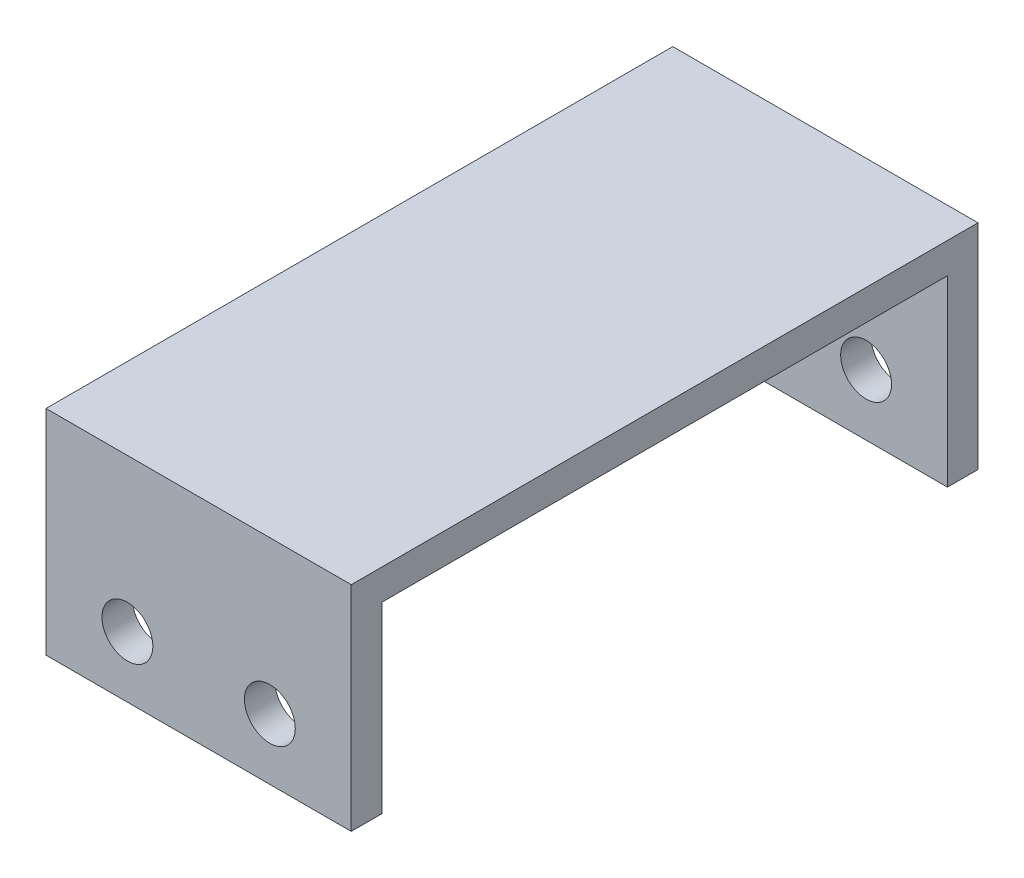
ISO-10303-21;
HEADER;
FILE_DESCRIPTION(('STEP AP214'),'2;1');
FILE_NAME('part.step','',(''),(''),'','','');
FILE_SCHEMA(('AUTOMOTIVE_DESIGN { 1 0 10303 214 1 1 1 1 }'));
ENDSEC;
DATA;
#1=APPLICATION_CONTEXT('core data for automotive mechanical design processes');
#2=APPLICATION_PROTOCOL_DEFINITION('international standard','automotive_design',2000,#1);
#3=PRODUCT_CONTEXT('',#1,'mechanical');
#4=PRODUCT('Part','Part','',(#3));
#5=PRODUCT_RELATED_PRODUCT_CATEGORY('part','',(#4));
#6=PRODUCT_DEFINITION_FORMATION('','',#4);
#7=PRODUCT_DEFINITION_CONTEXT('part definition',#1,'design');
#8=PRODUCT_DEFINITION('design','',#6,#7);
#9=PRODUCT_DEFINITION_SHAPE('','',#8);
#10=(LENGTH_UNIT() NAMED_UNIT(*) SI_UNIT(.MILLI.,.METRE.));
#11=(NAMED_UNIT(*) PLANE_ANGLE_UNIT() SI_UNIT($,.RADIAN.));
#12=(NAMED_UNIT(*) SI_UNIT($,.STERADIAN.) SOLID_ANGLE_UNIT());
#13=UNCERTAINTY_MEASURE_WITH_UNIT(LENGTH_MEASURE(1.E-05),#10,'distance_accuracy_value','');
#14=(GEOMETRIC_REPRESENTATION_CONTEXT(3) GLOBAL_UNCERTAINTY_ASSIGNED_CONTEXT((#13)) GLOBAL_UNIT_ASSIGNED_CONTEXT((#10,
#11,#12)) REPRESENTATION_CONTEXT('',''));
#15=CARTESIAN_POINT('',(0.,0.,0.));
#16=DIRECTION('',(0.,0.,1.));
#17=DIRECTION('',(1.,0.,0.));
#18=AXIS2_PLACEMENT_3D('',#15,#16,#17);
#19=CARTESIAN_POINT('',(0.,0.,0.));
#20=DIRECTION('',(0.,1.,0.));
#21=DIRECTION('',(0.,0.,1.));
#22=AXIS2_PLACEMENT_3D('',#19,#20,#21);
#23=PLANE('',#22);
#24=DIRECTION('',(-1.,0.,0.));
#25=VECTOR('',#24,1.);
#26=CARTESIAN_POINT('',(-13.0817610062893,0.,-15.8503144654088));
#27=LINE('',#26,#25);
#28=CARTESIAN_POINT('',(1.91823899371068,0.,-15.8503144654088));
#29=VERTEX_POINT('',#28);
#30=CARTESIAN_POINT('',(-13.0817610062893,0.,-15.8503144654088));
#31=VERTEX_POINT('',#30);
#32=EDGE_CURVE('E132',#29,#31,#27,.T.);
#33=ORIENTED_EDGE('',*,*,#32,.F.);
#34=DIRECTION('',(0.,0.,-1.));
#35=VECTOR('',#34,1.);
#36=CARTESIAN_POINT('',(1.91823899371068,0.,-17.3503144654088));
#37=LINE('',#36,#35);
#38=CARTESIAN_POINT('',(1.91823899371068,0.,11.9496855345912));
#39=VERTEX_POINT('',#38);
#40=EDGE_CURVE('E180',#39,#29,#37,.T.);
#41=ORIENTED_EDGE('',*,*,#40,.F.);
#42=DIRECTION('',(1.,0.,0.));
#43=VECTOR('',#42,1.);
#44=CARTESIAN_POINT('',(-13.0817610062893,0.,11.9496855345912));
#45=LINE('',#44,#43);
#46=CARTESIAN_POINT('',(-13.0817610062893,0.,11.9496855345912));
#47=VERTEX_POINT('',#46);
#48=EDGE_CURVE('E150',#47,#39,#45,.T.);
#49=ORIENTED_EDGE('',*,*,#48,.F.);
#50=DIRECTION('',(0.,0.,1.));
#51=VECTOR('',#50,1.);
#52=CARTESIAN_POINT('',(-13.0817610062893,0.,-17.3503144654088));
#53=LINE('',#52,#51);
#54=EDGE_CURVE('E57',#31,#47,#53,.T.);
#55=ORIENTED_EDGE('',*,*,#54,.F.);
#56=EDGE_LOOP('',(#33,#41,#49,#55));
#57=FACE_BOUND('',#56,.T.);
#58=ADVANCED_FACE('F39',(#57),#23,.F.);
#59=CARTESIAN_POINT('',(-13.0817610062893,1.5,-17.3503144654088));
#60=DIRECTION('',(1.,0.,0.));
#61=DIRECTION('',(0.,0.,-1.));
#62=AXIS2_PLACEMENT_3D('',#59,#60,#61);
#63=PLANE('',#62);
#64=DIRECTION('',(0.,-1.,0.));
#65=VECTOR('',#64,1.);
#66=CARTESIAN_POINT('',(-13.0817610062893,1.5,-17.3503144654088));
#67=LINE('',#66,#65);
#68=CARTESIAN_POINT('',(-13.0817610062893,1.5,-17.3503144654088));
#69=VERTEX_POINT('',#68);
#70=CARTESIAN_POINT('',(-13.0817610062893,-9.,-17.3503144654088));
#71=VERTEX_POINT('',#70);
#72=EDGE_CURVE('E108',#69,#71,#67,.T.);
#73=ORIENTED_EDGE('',*,*,#72,.T.);
#74=DIRECTION('',(0.,0.,-1.));
#75=VECTOR('',#74,1.);
#76=CARTESIAN_POINT('',(-13.0817610062893,-9.,-17.3503144654088));
#77=LINE('',#76,#75);
#78=CARTESIAN_POINT('',(-13.0817610062893,-9.,-15.8503144654088));
#79=VERTEX_POINT('',#78);
#80=EDGE_CURVE('E111',#79,#71,#77,.T.);
#81=ORIENTED_EDGE('',*,*,#80,.F.);
#82=DIRECTION('',(0.,1.,0.));
#83=VECTOR('',#82,1.);
#84=CARTESIAN_POINT('',(-13.0817610062893,-9.,-15.8503144654088));
#85=LINE('',#84,#83);
#86=EDGE_CURVE('E143',#79,#31,#85,.T.);
#87=ORIENTED_EDGE('',*,*,#86,.T.);
#88=ORIENTED_EDGE('',*,*,#54,.T.);
#89=DIRECTION('',(0.,1.,0.));
#90=VECTOR('',#89,1.);
#91=CARTESIAN_POINT('',(-13.0817610062893,-9.,11.9496855345912));
#92=LINE('',#91,#90);
#93=CARTESIAN_POINT('',(-13.0817610062893,-9.,11.9496855345912));
#94=VERTEX_POINT('',#93);
#95=EDGE_CURVE('E173',#94,#47,#92,.T.);
#96=ORIENTED_EDGE('',*,*,#95,.F.);
#97=DIRECTION('',(0.,0.,-1.));
#98=VECTOR('',#97,1.);
#99=CARTESIAN_POINT('',(-13.0817610062893,-9.,13.4496855345912));
#100=LINE('',#99,#98);
#101=CARTESIAN_POINT('',(-13.0817610062893,-9.,13.4496855345912));
#102=VERTEX_POINT('',#101);
#103=EDGE_CURVE('E151',#102,#94,#100,.T.);
#104=ORIENTED_EDGE('',*,*,#103,.F.);
#105=DIRECTION('',(0.,-1.,0.));
#106=VECTOR('',#105,1.);
#107=CARTESIAN_POINT('',(-13.0817610062893,1.5,13.4496855345912));
#108=LINE('',#107,#106);
#109=CARTESIAN_POINT('',(-13.0817610062893,1.5,13.4496855345912));
#110=VERTEX_POINT('',#109);
#111=EDGE_CURVE('E11',#110,#102,#108,.T.);
#112=ORIENTED_EDGE('',*,*,#111,.F.);
#113=DIRECTION('',(0.,0.,1.));
#114=VECTOR('',#113,1.);
#115=CARTESIAN_POINT('',(-13.0817610062893,1.5,-17.3503144654088));
#116=LINE('',#115,#114);
#117=EDGE_CURVE('E113',#69,#110,#116,.T.);
#118=ORIENTED_EDGE('',*,*,#117,.F.);
#119=EDGE_LOOP('',(#73,#81,#87,#88,#96,#104,#112,#118));
#120=FACE_BOUND('',#119,.T.);
#121=ADVANCED_FACE('F41',(#120),#63,.F.);
#122=CARTESIAN_POINT('',(-13.0817610062893,1.5,13.4496855345912));
#123=DIRECTION('',(0.,0.,-1.));
#124=DIRECTION('',(-1.,0.,0.));
#125=AXIS2_PLACEMENT_3D('',#122,#123,#124);
#126=PLANE('',#125);
#127=CARTESIAN_POINT('',(-9.08176100628932,-6.,13.4496855345912));
#128=DIRECTION('',(0.,0.,-1.));
#129=DIRECTION('',(-1.,0.,0.));
#130=AXIS2_PLACEMENT_3D('',#127,#128,#129);
#131=CIRCLE('',#130,1.25);
#132=CARTESIAN_POINT('',(-10.3317610062893,-6.,13.4496855345912));
#133=VERTEX_POINT('',#132);
#134=EDGE_CURVE('E135',#133,#133,#131,.T.);
#135=ORIENTED_EDGE('',*,*,#134,.T.);
#136=EDGE_LOOP('',(#135));
#137=FACE_BOUND('',#136,.T.);
#138=CARTESIAN_POINT('',(-2.08176100628932,-6.,13.4496855345912));
#139=DIRECTION('',(0.,0.,-1.));
#140=DIRECTION('',(-1.,0.,0.));
#141=AXIS2_PLACEMENT_3D('',#138,#139,#140);
#142=CIRCLE('',#141,1.25);
#143=CARTESIAN_POINT('',(-3.33176100628932,-6.,13.4496855345912));
#144=VERTEX_POINT('',#143);
#145=EDGE_CURVE('E206',#144,#144,#142,.T.);
#146=ORIENTED_EDGE('',*,*,#145,.T.);
#147=EDGE_LOOP('',(#146));
#148=FACE_BOUND('',#147,.T.);
#149=ORIENTED_EDGE('',*,*,#111,.T.);
#150=DIRECTION('',(-1.,0.,0.));
#151=VECTOR('',#150,1.);
#152=CARTESIAN_POINT('',(-13.0817610062893,-9.,13.4496855345912));
#153=LINE('',#152,#151);
#154=CARTESIAN_POINT('',(1.91823899371068,-9.,13.4496855345912));
#155=VERTEX_POINT('',#154);
#156=EDGE_CURVE('E162',#155,#102,#153,.T.);
#157=ORIENTED_EDGE('',*,*,#156,.F.);
#158=DIRECTION('',(0.,-1.,0.));
#159=VECTOR('',#158,1.);
#160=CARTESIAN_POINT('',(1.91823899371068,1.5,13.4496855345912));
#161=LINE('',#160,#159);
#162=CARTESIAN_POINT('',(1.91823899371068,1.5,13.4496855345912));
#163=VERTEX_POINT('',#162);
#164=EDGE_CURVE('E49',#163,#155,#161,.T.);
#165=ORIENTED_EDGE('',*,*,#164,.F.);
#166=DIRECTION('',(1.,0.,0.));
#167=VECTOR('',#166,1.);
#168=CARTESIAN_POINT('',(-13.0817610062893,1.5,13.4496855345912));
#169=LINE('',#168,#167);
#170=EDGE_CURVE('E179',#110,#163,#169,.T.);
#171=ORIENTED_EDGE('',*,*,#170,.F.);
#172=EDGE_LOOP('',(#149,#157,#165,#171));
#173=FACE_BOUND('',#172,.T.);
#174=ADVANCED_FACE('F254',(#137,#148,#173),#126,.F.);
#175=CARTESIAN_POINT('',(1.91823899371068,1.5,-17.3503144654088));
#176=DIRECTION('',(-1.,0.,0.));
#177=DIRECTION('',(0.,0.,1.));
#178=AXIS2_PLACEMENT_3D('',#175,#176,#177);
#179=PLANE('',#178);
#180=ORIENTED_EDGE('',*,*,#164,.T.);
#181=DIRECTION('',(0.,0.,1.));
#182=VECTOR('',#181,1.);
#183=CARTESIAN_POINT('',(1.91823899371068,-9.,13.4496855345912));
#184=LINE('',#183,#182);
#185=CARTESIAN_POINT('',(1.91823899371068,-9.,11.9496855345912));
#186=VERTEX_POINT('',#185);
#187=EDGE_CURVE('E158',#186,#155,#184,.T.);
#188=ORIENTED_EDGE('',*,*,#187,.F.);
#189=DIRECTION('',(0.,1.,0.));
#190=VECTOR('',#189,1.);
#191=CARTESIAN_POINT('',(1.91823899371068,-9.,11.9496855345912));
#192=LINE('',#191,#190);
#193=EDGE_CURVE('E166',#186,#39,#192,.T.);
#194=ORIENTED_EDGE('',*,*,#193,.T.);
#195=ORIENTED_EDGE('',*,*,#40,.T.);
#196=DIRECTION('',(0.,1.,0.));
#197=VECTOR('',#196,1.);
#198=CARTESIAN_POINT('',(1.91823899371068,-9.,-15.8503144654088));
#199=LINE('',#198,#197);
#200=CARTESIAN_POINT('',(1.91823899371068,-9.,-15.8503144654088));
#201=VERTEX_POINT('',#200);
#202=EDGE_CURVE('E147',#201,#29,#199,.T.);
#203=ORIENTED_EDGE('',*,*,#202,.F.);
#204=DIRECTION('',(0.,0.,1.));
#205=VECTOR('',#204,1.);
#206=CARTESIAN_POINT('',(1.91823899371068,-9.,-17.3503144654088));
#207=LINE('',#206,#205);
#208=CARTESIAN_POINT('',(1.91823899371068,-9.,-17.3503144654088));
#209=VERTEX_POINT('',#208);
#210=EDGE_CURVE('E125',#209,#201,#207,.T.);
#211=ORIENTED_EDGE('',*,*,#210,.F.);
#212=DIRECTION('',(0.,-1.,0.));
#213=VECTOR('',#212,1.);
#214=CARTESIAN_POINT('',(1.91823899371068,1.5,-17.3503144654088));
#215=LINE('',#214,#213);
#216=CARTESIAN_POINT('',(1.91823899371068,1.5,-17.3503144654088));
#217=VERTEX_POINT('',#216);
#218=EDGE_CURVE('E116',#217,#209,#215,.T.);
#219=ORIENTED_EDGE('',*,*,#218,.F.);
#220=DIRECTION('',(0.,0.,-1.));
#221=VECTOR('',#220,1.);
#222=CARTESIAN_POINT('',(1.91823899371068,1.5,-17.3503144654088));
#223=LINE('',#222,#221);
#224=EDGE_CURVE('E183',#163,#217,#223,.T.);
#225=ORIENTED_EDGE('',*,*,#224,.F.);
#226=EDGE_LOOP('',(#180,#188,#194,#195,#203,#211,#219,#225));
#227=FACE_BOUND('',#226,.T.);
#228=ADVANCED_FACE('F262',(#227),#179,.F.);
#229=CARTESIAN_POINT('',(-13.0817610062893,1.5,-17.3503144654088));
#230=DIRECTION('',(0.,0.,1.));
#231=DIRECTION('',(1.,0.,0.));
#232=AXIS2_PLACEMENT_3D('',#229,#230,#231);
#233=PLANE('',#232);
#234=CARTESIAN_POINT('',(-9.08176100628932,-6.,-17.3503144654088));
#235=DIRECTION('',(0.,0.,1.));
#236=DIRECTION('',(1.,0.,0.));
#237=AXIS2_PLACEMENT_3D('',#234,#235,#236);
#238=CIRCLE('',#237,1.25);
#239=CARTESIAN_POINT('',(-7.83176100628932,-6.,-17.3503144654088));
#240=VERTEX_POINT('',#239);
#241=EDGE_CURVE('E200',#240,#240,#238,.T.);
#242=ORIENTED_EDGE('',*,*,#241,.T.);
#243=EDGE_LOOP('',(#242));
#244=FACE_BOUND('',#243,.T.);
#245=CARTESIAN_POINT('',(-2.08176100628932,-6.,-17.3503144654088));
#246=DIRECTION('',(0.,0.,1.));
#247=DIRECTION('',(1.,0.,0.));
#248=AXIS2_PLACEMENT_3D('',#245,#246,#247);
#249=CIRCLE('',#248,1.25);
#250=CARTESIAN_POINT('',(-0.831761006289321,-6.,-17.3503144654088));
#251=VERTEX_POINT('',#250);
#252=EDGE_CURVE('E209',#251,#251,#249,.T.);
#253=ORIENTED_EDGE('',*,*,#252,.T.);
#254=EDGE_LOOP('',(#253));
#255=FACE_BOUND('',#254,.T.);
#256=ORIENTED_EDGE('',*,*,#218,.T.);
#257=DIRECTION('',(1.,0.,0.));
#258=VECTOR('',#257,1.);
#259=CARTESIAN_POINT('',(-13.0817610062893,-9.,-17.3503144654088));
#260=LINE('',#259,#258);
#261=EDGE_CURVE('E119',#71,#209,#260,.T.);
#262=ORIENTED_EDGE('',*,*,#261,.F.);
#263=ORIENTED_EDGE('',*,*,#72,.F.);
#264=DIRECTION('',(-1.,0.,0.));
#265=VECTOR('',#264,1.);
#266=CARTESIAN_POINT('',(-13.0817610062893,1.5,-17.3503144654088));
#267=LINE('',#266,#265);
#268=EDGE_CURVE('E65',#217,#69,#267,.T.);
#269=ORIENTED_EDGE('',*,*,#268,.F.);
#270=EDGE_LOOP('',(#256,#262,#263,#269));
#271=FACE_BOUND('',#270,.T.);
#272=ADVANCED_FACE('F120',(#244,#255,#271),#233,.F.);
#273=CARTESIAN_POINT('',(0.,1.5,0.));
#274=DIRECTION('',(0.,1.,0.));
#275=DIRECTION('',(0.,0.,1.));
#276=AXIS2_PLACEMENT_3D('',#273,#274,#275);
#277=PLANE('',#276);
#278=ORIENTED_EDGE('',*,*,#117,.T.);
#279=ORIENTED_EDGE('',*,*,#170,.T.);
#280=ORIENTED_EDGE('',*,*,#224,.T.);
#281=ORIENTED_EDGE('',*,*,#268,.T.);
#282=EDGE_LOOP('',(#278,#279,#280,#281));
#283=FACE_BOUND('',#282,.T.);
#284=ADVANCED_FACE('F258',(#283),#277,.T.);
#285=CARTESIAN_POINT('',(-13.0817610062893,-9.,11.9496855345912));
#286=DIRECTION('',(0.,0.,1.));
#287=DIRECTION('',(1.,0.,0.));
#288=AXIS2_PLACEMENT_3D('',#285,#286,#287);
#289=PLANE('',#288);
#290=CARTESIAN_POINT('',(-9.08176100628932,-6.,11.9496855345912));
#291=DIRECTION('',(0.,0.,1.));
#292=DIRECTION('',(1.,0.,0.));
#293=AXIS2_PLACEMENT_3D('',#290,#291,#292);
#294=CIRCLE('',#293,1.25);
#295=CARTESIAN_POINT('',(-7.83176100628932,-6.,11.9496855345912));
#296=VERTEX_POINT('',#295);
#297=EDGE_CURVE('E219',#296,#296,#294,.T.);
#298=ORIENTED_EDGE('',*,*,#297,.T.);
#299=EDGE_LOOP('',(#298));
#300=FACE_BOUND('',#299,.T.);
#301=CARTESIAN_POINT('',(-2.08176100628932,-6.,11.9496855345912));
#302=DIRECTION('',(0.,0.,1.));
#303=DIRECTION('',(1.,0.,0.));
#304=AXIS2_PLACEMENT_3D('',#301,#302,#303);
#305=CIRCLE('',#304,1.25);
#306=CARTESIAN_POINT('',(-0.831761006289321,-6.,11.9496855345912));
#307=VERTEX_POINT('',#306);
#308=EDGE_CURVE('E199',#307,#307,#305,.T.);
#309=ORIENTED_EDGE('',*,*,#308,.T.);
#310=EDGE_LOOP('',(#309));
#311=FACE_BOUND('',#310,.T.);
#312=ORIENTED_EDGE('',*,*,#48,.T.);
#313=ORIENTED_EDGE('',*,*,#193,.F.);
#314=DIRECTION('',(1.,0.,0.));
#315=VECTOR('',#314,1.);
#316=CARTESIAN_POINT('',(-13.0817610062893,-9.,11.9496855345912));
#317=LINE('',#316,#315);
#318=EDGE_CURVE('E155',#94,#186,#317,.T.);
#319=ORIENTED_EDGE('',*,*,#318,.F.);
#320=ORIENTED_EDGE('',*,*,#95,.T.);
#321=EDGE_LOOP('',(#312,#313,#319,#320));
#322=FACE_BOUND('',#321,.T.);
#323=ADVANCED_FACE('F280',(#300,#311,#322),#289,.F.);
#324=CARTESIAN_POINT('',(0.,-9.,0.));
#325=DIRECTION('',(0.,-1.,0.));
#326=DIRECTION('',(0.,0.,-1.));
#327=AXIS2_PLACEMENT_3D('',#324,#325,#326);
#328=PLANE('',#327);
#329=ORIENTED_EDGE('',*,*,#103,.T.);
#330=ORIENTED_EDGE('',*,*,#318,.T.);
#331=ORIENTED_EDGE('',*,*,#187,.T.);
#332=ORIENTED_EDGE('',*,*,#156,.T.);
#333=EDGE_LOOP('',(#329,#330,#331,#332));
#334=FACE_BOUND('',#333,.T.);
#335=ADVANCED_FACE('F277',(#334),#328,.T.);
#336=CARTESIAN_POINT('',(-13.0817610062893,-9.,-15.8503144654088));
#337=DIRECTION('',(0.,0.,-1.));
#338=DIRECTION('',(-1.,0.,0.));
#339=AXIS2_PLACEMENT_3D('',#336,#337,#338);
#340=PLANE('',#339);
#341=CARTESIAN_POINT('',(-9.08176100628932,-6.,-15.8503144654088));
#342=DIRECTION('',(0.,0.,-1.));
#343=DIRECTION('',(-1.,0.,0.));
#344=AXIS2_PLACEMENT_3D('',#341,#342,#343);
#345=CIRCLE('',#344,1.25);
#346=CARTESIAN_POINT('',(-10.3317610062893,-6.,-15.8503144654088));
#347=VERTEX_POINT('',#346);
#348=EDGE_CURVE('E43',#347,#347,#345,.T.);
#349=ORIENTED_EDGE('',*,*,#348,.T.);
#350=EDGE_LOOP('',(#349));
#351=FACE_BOUND('',#350,.T.);
#352=CARTESIAN_POINT('',(-2.08176100628932,-6.,-15.8503144654088));
#353=DIRECTION('',(0.,0.,-1.));
#354=DIRECTION('',(-1.,0.,0.));
#355=AXIS2_PLACEMENT_3D('',#352,#353,#354);
#356=CIRCLE('',#355,1.25);
#357=CARTESIAN_POINT('',(-3.33176100628932,-6.,-15.8503144654088));
#358=VERTEX_POINT('',#357);
#359=EDGE_CURVE('E196',#358,#358,#356,.T.);
#360=ORIENTED_EDGE('',*,*,#359,.T.);
#361=EDGE_LOOP('',(#360));
#362=FACE_BOUND('',#361,.T.);
#363=ORIENTED_EDGE('',*,*,#32,.T.);
#364=ORIENTED_EDGE('',*,*,#86,.F.);
#365=DIRECTION('',(-1.,0.,0.));
#366=VECTOR('',#365,1.);
#367=CARTESIAN_POINT('',(-13.0817610062893,-9.,-15.8503144654088));
#368=LINE('',#367,#366);
#369=EDGE_CURVE('E129',#201,#79,#368,.T.);
#370=ORIENTED_EDGE('',*,*,#369,.F.);
#371=ORIENTED_EDGE('',*,*,#202,.T.);
#372=EDGE_LOOP('',(#363,#364,#370,#371));
#373=FACE_BOUND('',#372,.T.);
#374=ADVANCED_FACE('F230',(#351,#362,#373),#340,.F.);
#375=CARTESIAN_POINT('',(0.,-9.,0.));
#376=DIRECTION('',(0.,1.,0.));
#377=DIRECTION('',(0.,0.,1.));
#378=AXIS2_PLACEMENT_3D('',#375,#376,#377);
#379=PLANE('',#378);
#380=ORIENTED_EDGE('',*,*,#80,.T.);
#381=ORIENTED_EDGE('',*,*,#261,.T.);
#382=ORIENTED_EDGE('',*,*,#210,.T.);
#383=ORIENTED_EDGE('',*,*,#369,.T.);
#384=EDGE_LOOP('',(#380,#381,#382,#383));
#385=FACE_BOUND('',#384,.T.);
#386=ADVANCED_FACE('F127',(#385),#379,.F.);
#387=CARTESIAN_POINT('',(-2.08176100628932,-6.,-17.3503144654088));
#388=DIRECTION('',(0.,0.,1.));
#389=DIRECTION('',(1.,0.,0.));
#390=AXIS2_PLACEMENT_3D('',#387,#388,#389);
#391=CYLINDRICAL_SURFACE('',#390,1.25);
#392=ORIENTED_EDGE('',*,*,#252,.F.);
#393=EDGE_LOOP('',(#392));
#394=FACE_BOUND('',#393,.T.);
#395=ORIENTED_EDGE('',*,*,#359,.F.);
#396=EDGE_LOOP('',(#395));
#397=FACE_BOUND('',#396,.T.);
#398=ADVANCED_FACE('F235',(#394,#397),#391,.F.);
#399=CARTESIAN_POINT('',(-9.08176100628932,-6.,-17.3503144654088));
#400=DIRECTION('',(0.,0.,1.));
#401=DIRECTION('',(1.,0.,0.));
#402=AXIS2_PLACEMENT_3D('',#399,#400,#401);
#403=CYLINDRICAL_SURFACE('',#402,1.25);
#404=ORIENTED_EDGE('',*,*,#241,.F.);
#405=EDGE_LOOP('',(#404));
#406=FACE_BOUND('',#405,.T.);
#407=ORIENTED_EDGE('',*,*,#348,.F.);
#408=EDGE_LOOP('',(#407));
#409=FACE_BOUND('',#408,.T.);
#410=ADVANCED_FACE('F232',(#406,#409),#403,.F.);
#411=ORIENTED_EDGE('',*,*,#308,.F.);
#412=EDGE_LOOP('',(#411));
#413=FACE_BOUND('',#412,.T.);
#414=ORIENTED_EDGE('',*,*,#145,.F.);
#415=EDGE_LOOP('',(#414));
#416=FACE_BOUND('',#415,.T.);
#417=ADVANCED_FACE('F234',(#413,#416),#391,.F.);
#418=ORIENTED_EDGE('',*,*,#297,.F.);
#419=EDGE_LOOP('',(#418));
#420=FACE_BOUND('',#419,.T.);
#421=ORIENTED_EDGE('',*,*,#134,.F.);
#422=EDGE_LOOP('',(#421));
#423=FACE_BOUND('',#422,.T.);
#424=ADVANCED_FACE('F238',(#420,#423),#403,.F.);
#425=CLOSED_SHELL('',(#58,#121,#174,#228,#272,#284,#323,#335,#374,#386,#398,#410,#417,#424));
#426=MANIFOLD_SOLID_BREP('B2',#425);
#427=ADVANCED_BREP_SHAPE_REPRESENTATION('',(#18,#426),#14);
#428=SHAPE_DEFINITION_REPRESENTATION(#9,#427);
ENDSEC;
END-ISO-10303-21;
